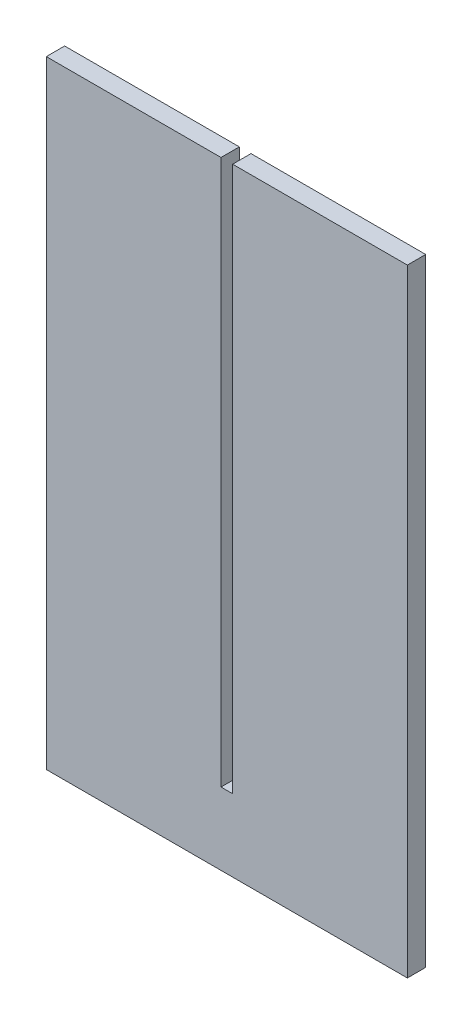
ISO-10303-21;
HEADER;
FILE_DESCRIPTION(('STEP AP214'),'2;1');
FILE_NAME('part.step','',(''),(''),'','','');
FILE_SCHEMA(('AUTOMOTIVE_DESIGN { 1 0 10303 214 1 1 1 1 }'));
ENDSEC;
DATA;
#1=APPLICATION_CONTEXT('core data for automotive mechanical design processes');
#2=APPLICATION_PROTOCOL_DEFINITION('international standard','automotive_design',2000,#1);
#3=PRODUCT_CONTEXT('',#1,'mechanical');
#4=PRODUCT('Part','Part','',(#3));
#5=PRODUCT_RELATED_PRODUCT_CATEGORY('part','',(#4));
#6=PRODUCT_DEFINITION_FORMATION('','',#4);
#7=PRODUCT_DEFINITION_CONTEXT('part definition',#1,'design');
#8=PRODUCT_DEFINITION('design','',#6,#7);
#9=PRODUCT_DEFINITION_SHAPE('','',#8);
#10=(LENGTH_UNIT() NAMED_UNIT(*) SI_UNIT(.MILLI.,.METRE.));
#11=(NAMED_UNIT(*) PLANE_ANGLE_UNIT() SI_UNIT($,.RADIAN.));
#12=(NAMED_UNIT(*) SI_UNIT($,.STERADIAN.) SOLID_ANGLE_UNIT());
#13=UNCERTAINTY_MEASURE_WITH_UNIT(LENGTH_MEASURE(1.E-05),#10,'distance_accuracy_value','');
#14=(GEOMETRIC_REPRESENTATION_CONTEXT(3) GLOBAL_UNCERTAINTY_ASSIGNED_CONTEXT((#13)) GLOBAL_UNIT_ASSIGNED_CONTEXT((#10,
#11,#12)) REPRESENTATION_CONTEXT('',''));
#15=CARTESIAN_POINT('',(0.,0.,0.));
#16=DIRECTION('',(0.,0.,1.));
#17=DIRECTION('',(1.,0.,0.));
#18=AXIS2_PLACEMENT_3D('',#15,#16,#17);
#19=CARTESIAN_POINT('',(199.839551417382,-147.646793579175,296.32270134492));
#20=DIRECTION('',(0.,-1.,0.));
#21=DIRECTION('',(0.,0.,-1.));
#22=AXIS2_PLACEMENT_3D('',#19,#20,#21);
#23=PLANE('',#22);
#24=DIRECTION('',(1.,0.,0.));
#25=VECTOR('',#24,1.);
#26=CARTESIAN_POINT('',(199.839551417382,-147.646793579175,296.830971220494));
#27=LINE('',#26,#25);
#28=CARTESIAN_POINT('',(214.839551417382,-147.646793579175,296.830971220494));
#29=VERTEX_POINT('',#28);
#30=CARTESIAN_POINT('',(224.839551417382,-147.646793579175,296.830971220494));
#31=VERTEX_POINT('',#30);
#32=EDGE_CURVE('E112',#29,#31,#27,.T.);
#33=ORIENTED_EDGE('',*,*,#32,.F.);
#34=DIRECTION('',(0.,0.,1.));
#35=VECTOR('',#34,1.);
#36=CARTESIAN_POINT('',(214.839551417382,-147.646793579175,296.32270134492));
#37=LINE('',#36,#35);
#38=CARTESIAN_POINT('',(214.839551417382,-147.646793579175,296.32270134492));
#39=VERTEX_POINT('',#38);
#40=EDGE_CURVE('E32',#39,#29,#37,.T.);
#41=ORIENTED_EDGE('',*,*,#40,.F.);
#42=DIRECTION('',(1.,0.,0.));
#43=VECTOR('',#42,1.);
#44=CARTESIAN_POINT('',(199.839551417382,-147.646793579175,296.32270134492));
#45=LINE('',#44,#43);
#46=CARTESIAN_POINT('',(224.839551417382,-147.646793579175,296.32270134492));
#47=VERTEX_POINT('',#46);
#48=EDGE_CURVE('E132',#39,#47,#45,.T.);
#49=ORIENTED_EDGE('',*,*,#48,.T.);
#50=DIRECTION('',(0.,0.,1.));
#51=VECTOR('',#50,1.);
#52=CARTESIAN_POINT('',(224.839551417382,-147.646793579175,296.32270134492));
#53=LINE('',#52,#51);
#54=EDGE_CURVE('E10',#47,#31,#53,.T.);
#55=ORIENTED_EDGE('',*,*,#54,.T.);
#56=EDGE_LOOP('',(#33,#41,#49,#55));
#57=FACE_BOUND('',#56,.T.);
#58=ADVANCED_FACE('F16',(#57),#23,.T.);
#59=CARTESIAN_POINT('',(224.839551417382,-113.096793579175,296.32270134492));
#60=DIRECTION('',(1.,0.,0.));
#61=DIRECTION('',(0.,1.,0.));
#62=AXIS2_PLACEMENT_3D('',#59,#60,#61);
#63=PLANE('',#62);
#64=DIRECTION('',(0.,1.,0.));
#65=VECTOR('',#64,1.);
#66=CARTESIAN_POINT('',(224.839551417382,-113.096793579175,296.830971220494));
#67=LINE('',#66,#65);
#68=CARTESIAN_POINT('',(224.839551417382,-130.546793579175,296.830971220494));
#69=VERTEX_POINT('',#68);
#70=EDGE_CURVE('E115',#31,#69,#67,.T.);
#71=ORIENTED_EDGE('',*,*,#70,.F.);
#72=ORIENTED_EDGE('',*,*,#54,.F.);
#73=DIRECTION('',(0.,1.,0.));
#74=VECTOR('',#73,1.);
#75=CARTESIAN_POINT('',(224.839551417382,-113.096793579175,296.32270134492));
#76=LINE('',#75,#74);
#77=CARTESIAN_POINT('',(224.839551417382,-130.546793579175,296.32270134492));
#78=VERTEX_POINT('',#77);
#79=EDGE_CURVE('E140',#47,#78,#76,.T.);
#80=ORIENTED_EDGE('',*,*,#79,.T.);
#81=DIRECTION('',(0.,0.,1.));
#82=VECTOR('',#81,1.);
#83=CARTESIAN_POINT('',(224.839551417382,-130.546793579175,296.32270134492));
#84=LINE('',#83,#82);
#85=EDGE_CURVE('E24',#78,#69,#84,.T.);
#86=ORIENTED_EDGE('',*,*,#85,.T.);
#87=EDGE_LOOP('',(#71,#72,#80,#86));
#88=FACE_BOUND('',#87,.T.);
#89=ADVANCED_FACE('F139',(#88),#63,.T.);
#90=CARTESIAN_POINT('',(199.839551417382,-130.546793579175,296.32270134492));
#91=DIRECTION('',(0.,-1.,0.));
#92=DIRECTION('',(1.,0.,0.));
#93=AXIS2_PLACEMENT_3D('',#90,#91,#92);
#94=PLANE('',#93);
#95=DIRECTION('',(1.,0.,0.));
#96=VECTOR('',#95,1.);
#97=CARTESIAN_POINT('',(199.839551417382,-130.546793579175,296.830971220494));
#98=LINE('',#97,#96);
#99=CARTESIAN_POINT('',(220.000793471445,-130.546793579175,296.830971220494));
#100=VERTEX_POINT('',#99);
#101=EDGE_CURVE('E118',#100,#69,#98,.T.);
#102=ORIENTED_EDGE('',*,*,#101,.T.);
#103=ORIENTED_EDGE('',*,*,#85,.F.);
#104=DIRECTION('',(1.,0.,0.));
#105=VECTOR('',#104,1.);
#106=CARTESIAN_POINT('',(199.839551417382,-130.546793579175,296.32270134492));
#107=LINE('',#106,#105);
#108=CARTESIAN_POINT('',(220.000793471445,-130.546793579175,296.32270134492));
#109=VERTEX_POINT('',#108);
#110=EDGE_CURVE('E150',#109,#78,#107,.T.);
#111=ORIENTED_EDGE('',*,*,#110,.F.);
#112=DIRECTION('',(0.,0.,1.));
#113=VECTOR('',#112,1.);
#114=CARTESIAN_POINT('',(220.000793471445,-130.546793579175,296.32270134492));
#115=LINE('',#114,#113);
#116=EDGE_CURVE('E138',#109,#100,#115,.T.);
#117=ORIENTED_EDGE('',*,*,#116,.T.);
#118=EDGE_LOOP('',(#102,#103,#111,#117));
#119=FACE_BOUND('',#118,.T.);
#120=ADVANCED_FACE('F145',(#119),#94,.F.);
#121=CARTESIAN_POINT('',(220.000793471445,-145.646793579175,296.32270134492));
#122=DIRECTION('',(-1.,0.,0.));
#123=DIRECTION('',(0.,-1.,0.));
#124=AXIS2_PLACEMENT_3D('',#121,#122,#123);
#125=PLANE('',#124);
#126=DIRECTION('',(0.,1.,0.));
#127=VECTOR('',#126,1.);
#128=CARTESIAN_POINT('',(220.000793471445,-145.646793579175,296.830971220494));
#129=LINE('',#128,#127);
#130=CARTESIAN_POINT('',(220.000793471445,-145.646793579175,296.830971220494));
#131=VERTEX_POINT('',#130);
#132=EDGE_CURVE('E121',#100,#131,#129,.F.);
#133=ORIENTED_EDGE('',*,*,#132,.F.);
#134=ORIENTED_EDGE('',*,*,#116,.F.);
#135=DIRECTION('',(0.,1.,0.));
#136=VECTOR('',#135,1.);
#137=CARTESIAN_POINT('',(220.000793471445,-145.646793579175,296.32270134492));
#138=LINE('',#137,#136);
#139=CARTESIAN_POINT('',(220.000793471445,-145.646793579175,296.32270134492));
#140=VERTEX_POINT('',#139);
#141=EDGE_CURVE('E154',#109,#140,#138,.F.);
#142=ORIENTED_EDGE('',*,*,#141,.T.);
#143=DIRECTION('',(0.,0.,1.));
#144=VECTOR('',#143,1.);
#145=CARTESIAN_POINT('',(220.000793471445,-145.646793579175,296.32270134492));
#146=LINE('',#145,#144);
#147=EDGE_CURVE('E136',#140,#131,#146,.T.);
#148=ORIENTED_EDGE('',*,*,#147,.T.);
#149=EDGE_LOOP('',(#133,#134,#142,#148));
#150=FACE_BOUND('',#149,.T.);
#151=ADVANCED_FACE('F161',(#150),#125,.T.);
#152=CARTESIAN_POINT('',(199.839551417382,-145.646793579175,296.32270134492));
#153=DIRECTION('',(0.,-1.,0.));
#154=DIRECTION('',(1.,0.,0.));
#155=AXIS2_PLACEMENT_3D('',#152,#153,#154);
#156=PLANE('',#155);
#157=DIRECTION('',(1.,0.,0.));
#158=VECTOR('',#157,1.);
#159=CARTESIAN_POINT('',(199.839551417382,-145.646793579175,296.830971220494));
#160=LINE('',#159,#158);
#161=CARTESIAN_POINT('',(219.678309363318,-145.646793579175,296.830971220494));
#162=VERTEX_POINT('',#161);
#163=EDGE_CURVE('E124',#162,#131,#160,.T.);
#164=ORIENTED_EDGE('',*,*,#163,.T.);
#165=ORIENTED_EDGE('',*,*,#147,.F.);
#166=DIRECTION('',(1.,0.,0.));
#167=VECTOR('',#166,1.);
#168=CARTESIAN_POINT('',(199.839551417382,-145.646793579175,296.32270134492));
#169=LINE('',#168,#167);
#170=CARTESIAN_POINT('',(219.678309363318,-145.646793579175,296.32270134492));
#171=VERTEX_POINT('',#170);
#172=EDGE_CURVE('E103',#171,#140,#169,.T.);
#173=ORIENTED_EDGE('',*,*,#172,.F.);
#174=DIRECTION('',(0.,0.,1.));
#175=VECTOR('',#174,1.);
#176=CARTESIAN_POINT('',(219.678309363318,-145.646793579175,296.32270134492));
#177=LINE('',#176,#175);
#178=EDGE_CURVE('E95',#171,#162,#177,.T.);
#179=ORIENTED_EDGE('',*,*,#178,.T.);
#180=EDGE_LOOP('',(#164,#165,#173,#179));
#181=FACE_BOUND('',#180,.T.);
#182=ADVANCED_FACE('F158',(#181),#156,.F.);
#183=CARTESIAN_POINT('',(219.678309363318,-145.646793579175,296.32270134492));
#184=DIRECTION('',(1.,0.,0.));
#185=DIRECTION('',(0.,1.,0.));
#186=AXIS2_PLACEMENT_3D('',#183,#184,#185);
#187=PLANE('',#186);
#188=DIRECTION('',(0.,1.,0.));
#189=VECTOR('',#188,1.);
#190=CARTESIAN_POINT('',(219.678309363318,-145.646793579175,296.830971220494));
#191=LINE('',#190,#189);
#192=CARTESIAN_POINT('',(219.678309363318,-130.546793579175,296.830971220494));
#193=VERTEX_POINT('',#192);
#194=EDGE_CURVE('E127',#162,#193,#191,.T.);
#195=ORIENTED_EDGE('',*,*,#194,.F.);
#196=ORIENTED_EDGE('',*,*,#178,.F.);
#197=DIRECTION('',(0.,1.,0.));
#198=VECTOR('',#197,1.);
#199=CARTESIAN_POINT('',(219.678309363318,-145.646793579175,296.32270134492));
#200=LINE('',#199,#198);
#201=CARTESIAN_POINT('',(219.678309363318,-130.546793579175,296.32270134492));
#202=VERTEX_POINT('',#201);
#203=EDGE_CURVE('E98',#171,#202,#200,.T.);
#204=ORIENTED_EDGE('',*,*,#203,.T.);
#205=DIRECTION('',(0.,0.,1.));
#206=VECTOR('',#205,1.);
#207=CARTESIAN_POINT('',(219.678309363318,-130.546793579175,296.32270134492));
#208=LINE('',#207,#206);
#209=EDGE_CURVE('E84',#202,#193,#208,.T.);
#210=ORIENTED_EDGE('',*,*,#209,.T.);
#211=EDGE_LOOP('',(#195,#196,#204,#210));
#212=FACE_BOUND('',#211,.T.);
#213=ADVANCED_FACE('F99',(#212),#187,.T.);
#214=CARTESIAN_POINT('',(199.839551417382,-130.546793579175,296.32270134492));
#215=DIRECTION('',(0.,-1.,0.));
#216=DIRECTION('',(1.,0.,0.));
#217=AXIS2_PLACEMENT_3D('',#214,#215,#216);
#218=PLANE('',#217);
#219=DIRECTION('',(1.,0.,0.));
#220=VECTOR('',#219,1.);
#221=CARTESIAN_POINT('',(199.839551417382,-130.546793579175,296.830971220494));
#222=LINE('',#221,#220);
#223=CARTESIAN_POINT('',(214.839551417381,-130.546793579175,296.830971220494));
#224=VERTEX_POINT('',#223);
#225=EDGE_CURVE('E91',#224,#193,#222,.T.);
#226=ORIENTED_EDGE('',*,*,#225,.T.);
#227=ORIENTED_EDGE('',*,*,#209,.F.);
#228=DIRECTION('',(1.,0.,0.));
#229=VECTOR('',#228,1.);
#230=CARTESIAN_POINT('',(199.839551417382,-130.546793579175,296.32270134492));
#231=LINE('',#230,#229);
#232=CARTESIAN_POINT('',(214.839551417381,-130.546793579175,296.32270134492));
#233=VERTEX_POINT('',#232);
#234=EDGE_CURVE('E88',#233,#202,#231,.T.);
#235=ORIENTED_EDGE('',*,*,#234,.F.);
#236=DIRECTION('',(0.,0.,1.));
#237=VECTOR('',#236,1.);
#238=CARTESIAN_POINT('',(214.839551417381,-130.546793579175,296.32270134492));
#239=LINE('',#238,#237);
#240=EDGE_CURVE('E60',#233,#224,#239,.T.);
#241=ORIENTED_EDGE('',*,*,#240,.T.);
#242=EDGE_LOOP('',(#226,#227,#235,#241));
#243=FACE_BOUND('',#242,.T.);
#244=ADVANCED_FACE('F86',(#243),#218,.F.);
#245=CARTESIAN_POINT('',(214.839551417382,-113.096793579175,296.32270134492));
#246=DIRECTION('',(1.,0.,0.));
#247=DIRECTION('',(0.,1.,0.));
#248=AXIS2_PLACEMENT_3D('',#245,#246,#247);
#249=PLANE('',#248);
#250=DIRECTION('',(0.,1.,0.));
#251=VECTOR('',#250,1.);
#252=CARTESIAN_POINT('',(214.839551417382,-113.096793579175,296.830971220494));
#253=LINE('',#252,#251);
#254=EDGE_CURVE('E130',#29,#224,#253,.T.);
#255=ORIENTED_EDGE('',*,*,#254,.T.);
#256=ORIENTED_EDGE('',*,*,#240,.F.);
#257=DIRECTION('',(0.,1.,0.));
#258=VECTOR('',#257,1.);
#259=CARTESIAN_POINT('',(214.839551417382,-113.096793579175,296.32270134492));
#260=LINE('',#259,#258);
#261=EDGE_CURVE('E107',#39,#233,#260,.T.);
#262=ORIENTED_EDGE('',*,*,#261,.F.);
#263=ORIENTED_EDGE('',*,*,#40,.T.);
#264=EDGE_LOOP('',(#255,#256,#262,#263));
#265=FACE_BOUND('',#264,.T.);
#266=ADVANCED_FACE('F217',(#265),#249,.F.);
#267=CARTESIAN_POINT('',(199.839551417382,-113.096793579175,296.32270134492));
#268=DIRECTION('',(0.,0.,1.));
#269=DIRECTION('',(0.,-1.,0.));
#270=AXIS2_PLACEMENT_3D('',#267,#268,#269);
#271=PLANE('',#270);
#272=ORIENTED_EDGE('',*,*,#48,.F.);
#273=ORIENTED_EDGE('',*,*,#261,.T.);
#274=ORIENTED_EDGE('',*,*,#234,.T.);
#275=ORIENTED_EDGE('',*,*,#203,.F.);
#276=ORIENTED_EDGE('',*,*,#172,.T.);
#277=ORIENTED_EDGE('',*,*,#141,.F.);
#278=ORIENTED_EDGE('',*,*,#110,.T.);
#279=ORIENTED_EDGE('',*,*,#79,.F.);
#280=EDGE_LOOP('',(#272,#273,#274,#275,#276,#277,#278,#279));
#281=FACE_BOUND('',#280,.T.);
#282=ADVANCED_FACE('F106',(#281),#271,.F.);
#283=CARTESIAN_POINT('',(199.839551417382,-113.096793579175,296.830971220494));
#284=DIRECTION('',(0.,0.,1.));
#285=DIRECTION('',(0.,-1.,0.));
#286=AXIS2_PLACEMENT_3D('',#283,#284,#285);
#287=PLANE('',#286);
#288=ORIENTED_EDGE('',*,*,#32,.T.);
#289=ORIENTED_EDGE('',*,*,#70,.T.);
#290=ORIENTED_EDGE('',*,*,#101,.F.);
#291=ORIENTED_EDGE('',*,*,#132,.T.);
#292=ORIENTED_EDGE('',*,*,#163,.F.);
#293=ORIENTED_EDGE('',*,*,#194,.T.);
#294=ORIENTED_EDGE('',*,*,#225,.F.);
#295=ORIENTED_EDGE('',*,*,#254,.F.);
#296=EDGE_LOOP('',(#288,#289,#290,#291,#292,#293,#294,#295));
#297=FACE_BOUND('',#296,.T.);
#298=ADVANCED_FACE('F148',(#297),#287,.T.);
#299=CLOSED_SHELL('',(#58,#89,#120,#151,#182,#213,#244,#266,#282,#298));
#300=MANIFOLD_SOLID_BREP('B1',#299);
#301=ADVANCED_BREP_SHAPE_REPRESENTATION('',(#18,#300),#14);
#302=SHAPE_DEFINITION_REPRESENTATION(#9,#301);
ENDSEC;
END-ISO-10303-21;
